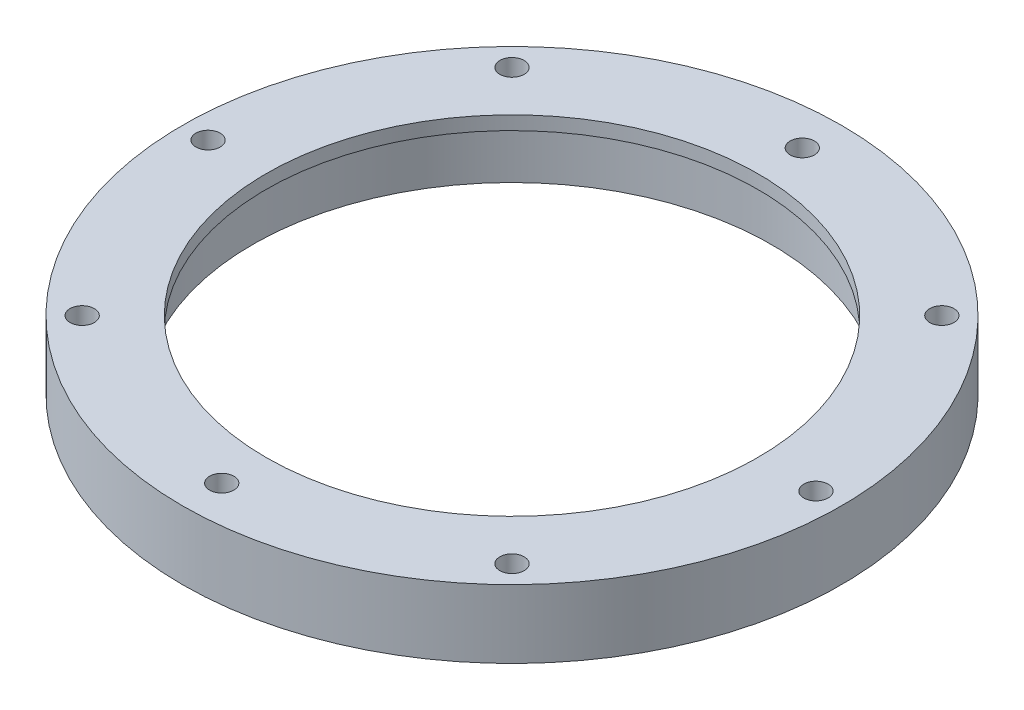
ISO-10303-21;
HEADER;
FILE_DESCRIPTION(('STEP AP214'),'2;1');
FILE_NAME('part.step','',(''),(''),'','','');
FILE_SCHEMA(('AUTOMOTIVE_DESIGN { 1 0 10303 214 1 1 1 1 }'));
ENDSEC;
DATA;
#1=APPLICATION_CONTEXT('core data for automotive mechanical design processes');
#2=APPLICATION_PROTOCOL_DEFINITION('international standard','automotive_design',2000,#1);
#3=PRODUCT_CONTEXT('',#1,'mechanical');
#4=PRODUCT('Part','Part','',(#3));
#5=PRODUCT_RELATED_PRODUCT_CATEGORY('part','',(#4));
#6=PRODUCT_DEFINITION_FORMATION('','',#4);
#7=PRODUCT_DEFINITION_CONTEXT('part definition',#1,'design');
#8=PRODUCT_DEFINITION('design','',#6,#7);
#9=PRODUCT_DEFINITION_SHAPE('','',#8);
#10=(LENGTH_UNIT() NAMED_UNIT(*) SI_UNIT(.MILLI.,.METRE.));
#11=(NAMED_UNIT(*) PLANE_ANGLE_UNIT() SI_UNIT($,.RADIAN.));
#12=(NAMED_UNIT(*) SI_UNIT($,.STERADIAN.) SOLID_ANGLE_UNIT());
#13=UNCERTAINTY_MEASURE_WITH_UNIT(LENGTH_MEASURE(1.E-05),#10,'distance_accuracy_value','');
#14=(GEOMETRIC_REPRESENTATION_CONTEXT(3) GLOBAL_UNCERTAINTY_ASSIGNED_CONTEXT((#13)) GLOBAL_UNIT_ASSIGNED_CONTEXT((#10,
#11,#12)) REPRESENTATION_CONTEXT('',''));
#15=CARTESIAN_POINT('',(0.,0.,0.));
#16=DIRECTION('',(0.,0.,1.));
#17=DIRECTION('',(1.,0.,0.));
#18=AXIS2_PLACEMENT_3D('',#15,#16,#17);
#19=CARTESIAN_POINT('',(0.,10.,0.));
#20=DIRECTION('',(0.,-1.,0.));
#21=DIRECTION('',(0.,0.,-1.));
#22=AXIS2_PLACEMENT_3D('',#19,#20,#21);
#23=CYLINDRICAL_SURFACE('',#22,38.);
#24=CARTESIAN_POINT('',(0.,0.,0.));
#25=DIRECTION('',(0.,1.,0.));
#26=DIRECTION('',(0.,0.,1.));
#27=AXIS2_PLACEMENT_3D('',#24,#25,#26);
#28=CIRCLE('',#27,38.);
#29=CARTESIAN_POINT('',(0.,0.,38.));
#30=VERTEX_POINT('',#29);
#31=EDGE_CURVE('E50',#30,#30,#28,.T.);
#32=ORIENTED_EDGE('',*,*,#31,.F.);
#33=EDGE_LOOP('',(#32));
#34=FACE_BOUND('',#33,.T.);
#35=CARTESIAN_POINT('',(0.,8.,0.));
#36=DIRECTION('',(0.,1.,0.));
#37=DIRECTION('',(0.,0.,1.));
#38=AXIS2_PLACEMENT_3D('',#35,#36,#37);
#39=CIRCLE('',#38,38.);
#40=CARTESIAN_POINT('',(0.,8.,38.));
#41=VERTEX_POINT('',#40);
#42=EDGE_CURVE('E81',#41,#41,#39,.T.);
#43=ORIENTED_EDGE('',*,*,#42,.T.);
#44=EDGE_LOOP('',(#43));
#45=FACE_BOUND('',#44,.T.);
#46=ADVANCED_FACE('F37',(#34,#45),#23,.F.);
#47=CARTESIAN_POINT('',(0.,10.,0.));
#48=DIRECTION('',(0.,1.,0.));
#49=DIRECTION('',(0.,0.,1.));
#50=AXIS2_PLACEMENT_3D('',#47,#48,#49);
#51=PLANE('',#50);
#52=CARTESIAN_POINT('',(5.5258133610514E-05,10.,42.5000795900453));
#53=DIRECTION('',(0.,1.,0.));
#54=DIRECTION('',(0.,0.,1.));
#55=AXIS2_PLACEMENT_3D('',#52,#53,#54);
#56=CIRCLE('',#55,1.775);
#57=CARTESIAN_POINT('',(5.5258133610514E-05,10.,44.2750795900453));
#58=VERTEX_POINT('',#57);
#59=EDGE_CURVE('E171',#58,#58,#56,.T.);
#60=ORIENTED_EDGE('',*,*,#59,.F.);
#61=EDGE_LOOP('',(#60));
#62=FACE_BOUND('',#61,.T.);
#63=CARTESIAN_POINT('',(2.4325513686696E-05,10.,-42.4999999985669));
#64=DIRECTION('',(0.,1.,0.));
#65=DIRECTION('',(0.,0.,1.));
#66=AXIS2_PLACEMENT_3D('',#63,#64,#65);
#67=CIRCLE('',#66,1.775);
#68=CARTESIAN_POINT('',(2.4325513686696E-05,10.,-40.7249999985669));
#69=VERTEX_POINT('',#68);
#70=EDGE_CURVE('E175',#69,#69,#67,.T.);
#71=ORIENTED_EDGE('',*,*,#70,.F.);
#72=EDGE_LOOP('',(#71));
#73=FACE_BOUND('',#72,.T.);
#74=CARTESIAN_POINT('',(31.4662517628014,10.,31.4662517628014));
#75=DIRECTION('',(0.,-1.,0.));
#76=DIRECTION('',(0.,0.,-1.));
#77=AXIS2_PLACEMENT_3D('',#74,#75,#76);
#78=CIRCLE('',#77,1.77500000000008);
#79=CARTESIAN_POINT('',(31.4662517628014,10.,29.6912517628013));
#80=VERTEX_POINT('',#79);
#81=EDGE_CURVE('E59',#80,#80,#78,.T.);
#82=ORIENTED_EDGE('',*,*,#81,.T.);
#83=EDGE_LOOP('',(#82));
#84=FACE_BOUND('',#83,.T.);
#85=CARTESIAN_POINT('',(44.5,10.,0.));
#86=DIRECTION('',(0.,-1.,0.));
#87=DIRECTION('',(0.,0.,-1.));
#88=AXIS2_PLACEMENT_3D('',#85,#86,#87);
#89=CIRCLE('',#88,1.77500000000015);
#90=CARTESIAN_POINT('',(44.5,10.,-1.77500000000015));
#91=VERTEX_POINT('',#90);
#92=EDGE_CURVE('E182',#91,#91,#89,.T.);
#93=ORIENTED_EDGE('',*,*,#92,.T.);
#94=EDGE_LOOP('',(#93));
#95=FACE_BOUND('',#94,.T.);
#96=CARTESIAN_POINT('',(31.4662517628014,10.,-31.4662517628014));
#97=DIRECTION('',(0.,-1.,0.));
#98=DIRECTION('',(0.,0.,-1.));
#99=AXIS2_PLACEMENT_3D('',#96,#97,#98);
#100=CIRCLE('',#99,1.77500000000024);
#101=CARTESIAN_POINT('',(31.4662517628014,10.,-33.2412517628016));
#102=VERTEX_POINT('',#101);
#103=EDGE_CURVE('E185',#102,#102,#100,.T.);
#104=ORIENTED_EDGE('',*,*,#103,.T.);
#105=EDGE_LOOP('',(#104));
#106=FACE_BOUND('',#105,.T.);
#107=CARTESIAN_POINT('',(-31.4662517628014,10.,-31.4662517628014));
#108=DIRECTION('',(0.,-1.,0.));
#109=DIRECTION('',(0.,0.,-1.));
#110=AXIS2_PLACEMENT_3D('',#107,#108,#109);
#111=CIRCLE('',#110,1.77500000000038);
#112=CARTESIAN_POINT('',(-31.4662517628014,10.,-33.2412517628018));
#113=VERTEX_POINT('',#112);
#114=EDGE_CURVE('E188',#113,#113,#111,.T.);
#115=ORIENTED_EDGE('',*,*,#114,.T.);
#116=EDGE_LOOP('',(#115));
#117=FACE_BOUND('',#116,.T.);
#118=CARTESIAN_POINT('',(-44.5,10.,0.));
#119=DIRECTION('',(0.,-1.,0.));
#120=DIRECTION('',(0.,0.,-1.));
#121=AXIS2_PLACEMENT_3D('',#118,#119,#120);
#122=CIRCLE('',#121,1.77500000000045);
#123=CARTESIAN_POINT('',(-44.5,10.,-1.77500000000046));
#124=VERTEX_POINT('',#123);
#125=EDGE_CURVE('E191',#124,#124,#122,.T.);
#126=ORIENTED_EDGE('',*,*,#125,.T.);
#127=EDGE_LOOP('',(#126));
#128=FACE_BOUND('',#127,.T.);
#129=CARTESIAN_POINT('',(-31.4662517628014,10.,31.4662517628013));
#130=DIRECTION('',(0.,-1.,0.));
#131=DIRECTION('',(0.,0.,-1.));
#132=AXIS2_PLACEMENT_3D('',#129,#130,#131);
#133=CIRCLE('',#132,1.77500000000053);
#134=CARTESIAN_POINT('',(-31.4662517628014,10.,29.6912517628008));
#135=VERTEX_POINT('',#134);
#136=EDGE_CURVE('E173',#135,#135,#133,.T.);
#137=ORIENTED_EDGE('',*,*,#136,.T.);
#138=EDGE_LOOP('',(#137));
#139=FACE_BOUND('',#138,.T.);
#140=CARTESIAN_POINT('',(0.,10.,0.));
#141=DIRECTION('',(0.,1.,0.));
#142=DIRECTION('',(0.,0.,1.));
#143=AXIS2_PLACEMENT_3D('',#140,#141,#142);
#144=CIRCLE('',#143,48.25);
#145=CARTESIAN_POINT('',(0.,10.,48.25));
#146=VERTEX_POINT('',#145);
#147=EDGE_CURVE('E10',#146,#146,#144,.T.);
#148=ORIENTED_EDGE('',*,*,#147,.T.);
#149=EDGE_LOOP('',(#148));
#150=FACE_BOUND('',#149,.T.);
#151=CARTESIAN_POINT('',(0.,10.,0.));
#152=DIRECTION('',(0.,1.,0.));
#153=DIRECTION('',(0.,0.,1.));
#154=AXIS2_PLACEMENT_3D('',#151,#152,#153);
#155=CIRCLE('',#154,36.);
#156=CARTESIAN_POINT('',(0.,10.,36.));
#157=VERTEX_POINT('',#156);
#158=EDGE_CURVE('E72',#157,#157,#155,.T.);
#159=ORIENTED_EDGE('',*,*,#158,.F.);
#160=EDGE_LOOP('',(#159));
#161=FACE_BOUND('',#160,.T.);
#162=ADVANCED_FACE('F93',(#62,#73,#84,#95,#106,#117,#128,#139,#150,#161),#51,.T.);
#163=CARTESIAN_POINT('',(0.,0.,0.));
#164=DIRECTION('',(0.,1.,0.));
#165=DIRECTION('',(0.,0.,1.));
#166=AXIS2_PLACEMENT_3D('',#163,#164,#165);
#167=PLANE('',#166);
#168=CARTESIAN_POINT('',(5.5258133610514E-05,0.,42.5000795900453));
#169=DIRECTION('',(0.,1.,0.));
#170=DIRECTION('',(0.,0.,1.));
#171=AXIS2_PLACEMENT_3D('',#168,#169,#170);
#172=CIRCLE('',#171,1.775);
#173=CARTESIAN_POINT('',(5.5258133610514E-05,0.,44.2750795900453));
#174=VERTEX_POINT('',#173);
#175=EDGE_CURVE('E112',#174,#174,#172,.F.);
#176=ORIENTED_EDGE('',*,*,#175,.F.);
#177=EDGE_LOOP('',(#176));
#178=FACE_BOUND('',#177,.T.);
#179=CARTESIAN_POINT('',(2.4325513686696E-05,0.,-42.4999999985669));
#180=DIRECTION('',(0.,1.,0.));
#181=DIRECTION('',(0.,0.,1.));
#182=AXIS2_PLACEMENT_3D('',#179,#180,#181);
#183=CIRCLE('',#182,1.775);
#184=CARTESIAN_POINT('',(2.4325513686696E-05,0.,-40.7249999985669));
#185=VERTEX_POINT('',#184);
#186=EDGE_CURVE('E115',#185,#185,#183,.F.);
#187=ORIENTED_EDGE('',*,*,#186,.F.);
#188=EDGE_LOOP('',(#187));
#189=FACE_BOUND('',#188,.T.);
#190=CARTESIAN_POINT('',(31.4662517628014,0.,31.4662517628014));
#191=DIRECTION('',(0.,1.,0.));
#192=DIRECTION('',(0.,0.,1.));
#193=AXIS2_PLACEMENT_3D('',#190,#191,#192);
#194=CIRCLE('',#193,1.77500000000008);
#195=CARTESIAN_POINT('',(31.4662517628014,0.,33.2412517628014));
#196=VERTEX_POINT('',#195);
#197=EDGE_CURVE('E41',#196,#196,#194,.T.);
#198=ORIENTED_EDGE('',*,*,#197,.T.);
#199=EDGE_LOOP('',(#198));
#200=FACE_BOUND('',#199,.T.);
#201=CARTESIAN_POINT('',(44.5,0.,0.));
#202=DIRECTION('',(0.,1.,0.));
#203=DIRECTION('',(0.,0.,1.));
#204=AXIS2_PLACEMENT_3D('',#201,#202,#203);
#205=CIRCLE('',#204,1.77500000000015);
#206=CARTESIAN_POINT('',(44.5,0.,1.77500000000016));
#207=VERTEX_POINT('',#206);
#208=EDGE_CURVE('E67',#207,#207,#205,.T.);
#209=ORIENTED_EDGE('',*,*,#208,.T.);
#210=EDGE_LOOP('',(#209));
#211=FACE_BOUND('',#210,.T.);
#212=CARTESIAN_POINT('',(31.4662517628014,0.,-31.4662517628014));
#213=DIRECTION('',(0.,1.,0.));
#214=DIRECTION('',(0.,0.,1.));
#215=AXIS2_PLACEMENT_3D('',#212,#213,#214);
#216=CIRCLE('',#215,1.77500000000024);
#217=CARTESIAN_POINT('',(31.4662517628014,0.,-29.6912517628011));
#218=VERTEX_POINT('',#217);
#219=EDGE_CURVE('E65',#218,#218,#216,.T.);
#220=ORIENTED_EDGE('',*,*,#219,.T.);
#221=EDGE_LOOP('',(#220));
#222=FACE_BOUND('',#221,.T.);
#223=CARTESIAN_POINT('',(-31.4662517628014,0.,-31.4662517628014));
#224=DIRECTION('',(0.,1.,0.));
#225=DIRECTION('',(0.,0.,1.));
#226=AXIS2_PLACEMENT_3D('',#223,#224,#225);
#227=CIRCLE('',#226,1.77500000000038);
#228=CARTESIAN_POINT('',(-31.4662517628014,0.,-29.691251762801));
#229=VERTEX_POINT('',#228);
#230=EDGE_CURVE('E62',#229,#229,#227,.T.);
#231=ORIENTED_EDGE('',*,*,#230,.T.);
#232=EDGE_LOOP('',(#231));
#233=FACE_BOUND('',#232,.T.);
#234=CARTESIAN_POINT('',(-44.5,0.,0.));
#235=DIRECTION('',(0.,1.,0.));
#236=DIRECTION('',(0.,0.,1.));
#237=AXIS2_PLACEMENT_3D('',#234,#235,#236);
#238=CIRCLE('',#237,1.77500000000045);
#239=CARTESIAN_POINT('',(-44.5,0.,1.77500000000045));
#240=VERTEX_POINT('',#239);
#241=EDGE_CURVE('E58',#240,#240,#238,.T.);
#242=ORIENTED_EDGE('',*,*,#241,.T.);
#243=EDGE_LOOP('',(#242));
#244=FACE_BOUND('',#243,.T.);
#245=CARTESIAN_POINT('',(-31.4662517628014,0.,31.4662517628013));
#246=DIRECTION('',(0.,1.,0.));
#247=DIRECTION('',(0.,0.,1.));
#248=AXIS2_PLACEMENT_3D('',#245,#246,#247);
#249=CIRCLE('',#248,1.77500000000053);
#250=CARTESIAN_POINT('',(-31.4662517628014,0.,33.2412517628019));
#251=VERTEX_POINT('',#250);
#252=EDGE_CURVE('E55',#251,#251,#249,.T.);
#253=ORIENTED_EDGE('',*,*,#252,.T.);
#254=EDGE_LOOP('',(#253));
#255=FACE_BOUND('',#254,.T.);
#256=CARTESIAN_POINT('',(0.,0.,0.));
#257=DIRECTION('',(0.,1.,0.));
#258=DIRECTION('',(0.,0.,1.));
#259=AXIS2_PLACEMENT_3D('',#256,#257,#258);
#260=CIRCLE('',#259,48.25);
#261=CARTESIAN_POINT('',(0.,0.,48.25));
#262=VERTEX_POINT('',#261);
#263=EDGE_CURVE('E45',#262,#262,#260,.T.);
#264=ORIENTED_EDGE('',*,*,#263,.F.);
#265=EDGE_LOOP('',(#264));
#266=FACE_BOUND('',#265,.T.);
#267=ORIENTED_EDGE('',*,*,#31,.T.);
#268=EDGE_LOOP('',(#267));
#269=FACE_BOUND('',#268,.T.);
#270=ADVANCED_FACE('F90',(#178,#189,#200,#211,#222,#233,#244,#255,#266,#269),#167,.F.);
#271=CARTESIAN_POINT('',(0.,10.,0.));
#272=DIRECTION('',(0.,-1.,0.));
#273=DIRECTION('',(0.,0.,-1.));
#274=AXIS2_PLACEMENT_3D('',#271,#272,#273);
#275=CYLINDRICAL_SURFACE('',#274,48.25);
#276=ORIENTED_EDGE('',*,*,#147,.F.);
#277=EDGE_LOOP('',(#276));
#278=FACE_BOUND('',#277,.T.);
#279=ORIENTED_EDGE('',*,*,#263,.T.);
#280=EDGE_LOOP('',(#279));
#281=FACE_BOUND('',#280,.T.);
#282=ADVANCED_FACE('F39',(#278,#281),#275,.T.);
#283=CARTESIAN_POINT('',(0.,8.,0.));
#284=DIRECTION('',(0.,1.,0.));
#285=DIRECTION('',(0.,0.,1.));
#286=AXIS2_PLACEMENT_3D('',#283,#284,#285);
#287=PLANE('',#286);
#288=CARTESIAN_POINT('',(0.,8.,0.));
#289=DIRECTION('',(0.,1.,0.));
#290=DIRECTION('',(0.,0.,1.));
#291=AXIS2_PLACEMENT_3D('',#288,#289,#290);
#292=CIRCLE('',#291,36.);
#293=CARTESIAN_POINT('',(0.,8.,36.));
#294=VERTEX_POINT('',#293);
#295=EDGE_CURVE('E76',#294,#294,#292,.T.);
#296=ORIENTED_EDGE('',*,*,#295,.T.);
#297=EDGE_LOOP('',(#296));
#298=FACE_BOUND('',#297,.T.);
#299=ORIENTED_EDGE('',*,*,#42,.F.);
#300=EDGE_LOOP('',(#299));
#301=FACE_BOUND('',#300,.T.);
#302=ADVANCED_FACE('F101',(#298,#301),#287,.F.);
#303=CARTESIAN_POINT('',(0.,8.,0.));
#304=DIRECTION('',(0.,1.,0.));
#305=DIRECTION('',(0.,0.,1.));
#306=AXIS2_PLACEMENT_3D('',#303,#304,#305);
#307=CYLINDRICAL_SURFACE('',#306,36.);
#308=ORIENTED_EDGE('',*,*,#295,.F.);
#309=EDGE_LOOP('',(#308));
#310=FACE_BOUND('',#309,.T.);
#311=ORIENTED_EDGE('',*,*,#158,.T.);
#312=EDGE_LOOP('',(#311));
#313=FACE_BOUND('',#312,.T.);
#314=ADVANCED_FACE('F131',(#310,#313),#307,.F.);
#315=CARTESIAN_POINT('',(-31.4662517628014,10.,31.4662517628013));
#316=DIRECTION('',(0.,-1.,0.));
#317=DIRECTION('',(0.,0.,-1.));
#318=AXIS2_PLACEMENT_3D('',#315,#316,#317);
#319=CYLINDRICAL_SURFACE('',#318,1.77500000000053);
#320=ORIENTED_EDGE('',*,*,#136,.F.);
#321=EDGE_LOOP('',(#320));
#322=FACE_BOUND('',#321,.T.);
#323=ORIENTED_EDGE('',*,*,#252,.F.);
#324=EDGE_LOOP('',(#323));
#325=FACE_BOUND('',#324,.T.);
#326=ADVANCED_FACE('F128',(#322,#325),#319,.F.);
#327=CARTESIAN_POINT('',(-44.5,10.,0.));
#328=DIRECTION('',(0.,-1.,0.));
#329=DIRECTION('',(0.,0.,-1.));
#330=AXIS2_PLACEMENT_3D('',#327,#328,#329);
#331=CYLINDRICAL_SURFACE('',#330,1.77500000000045);
#332=ORIENTED_EDGE('',*,*,#125,.F.);
#333=EDGE_LOOP('',(#332));
#334=FACE_BOUND('',#333,.T.);
#335=ORIENTED_EDGE('',*,*,#241,.F.);
#336=EDGE_LOOP('',(#335));
#337=FACE_BOUND('',#336,.T.);
#338=ADVANCED_FACE('F130',(#334,#337),#331,.F.);
#339=CARTESIAN_POINT('',(-31.4662517628014,10.,-31.4662517628014));
#340=DIRECTION('',(0.,-1.,0.));
#341=DIRECTION('',(0.,0.,-1.));
#342=AXIS2_PLACEMENT_3D('',#339,#340,#341);
#343=CYLINDRICAL_SURFACE('',#342,1.77500000000038);
#344=ORIENTED_EDGE('',*,*,#114,.F.);
#345=EDGE_LOOP('',(#344));
#346=FACE_BOUND('',#345,.T.);
#347=ORIENTED_EDGE('',*,*,#230,.F.);
#348=EDGE_LOOP('',(#347));
#349=FACE_BOUND('',#348,.T.);
#350=ADVANCED_FACE('F138',(#346,#349),#343,.F.);
#351=CARTESIAN_POINT('',(31.4662517628014,10.,-31.4662517628014));
#352=DIRECTION('',(0.,-1.,0.));
#353=DIRECTION('',(0.,0.,-1.));
#354=AXIS2_PLACEMENT_3D('',#351,#352,#353);
#355=CYLINDRICAL_SURFACE('',#354,1.77500000000024);
#356=ORIENTED_EDGE('',*,*,#103,.F.);
#357=EDGE_LOOP('',(#356));
#358=FACE_BOUND('',#357,.T.);
#359=ORIENTED_EDGE('',*,*,#219,.F.);
#360=EDGE_LOOP('',(#359));
#361=FACE_BOUND('',#360,.T.);
#362=ADVANCED_FACE('F146',(#358,#361),#355,.F.);
#363=CARTESIAN_POINT('',(44.5,10.,0.));
#364=DIRECTION('',(0.,-1.,0.));
#365=DIRECTION('',(0.,0.,-1.));
#366=AXIS2_PLACEMENT_3D('',#363,#364,#365);
#367=CYLINDRICAL_SURFACE('',#366,1.77500000000015);
#368=ORIENTED_EDGE('',*,*,#92,.F.);
#369=EDGE_LOOP('',(#368));
#370=FACE_BOUND('',#369,.T.);
#371=ORIENTED_EDGE('',*,*,#208,.F.);
#372=EDGE_LOOP('',(#371));
#373=FACE_BOUND('',#372,.T.);
#374=ADVANCED_FACE('F150',(#370,#373),#367,.F.);
#375=CARTESIAN_POINT('',(31.4662517628014,10.,31.4662517628014));
#376=DIRECTION('',(0.,-1.,0.));
#377=DIRECTION('',(0.,0.,-1.));
#378=AXIS2_PLACEMENT_3D('',#375,#376,#377);
#379=CYLINDRICAL_SURFACE('',#378,1.77500000000008);
#380=ORIENTED_EDGE('',*,*,#81,.F.);
#381=EDGE_LOOP('',(#380));
#382=FACE_BOUND('',#381,.T.);
#383=ORIENTED_EDGE('',*,*,#197,.F.);
#384=EDGE_LOOP('',(#383));
#385=FACE_BOUND('',#384,.T.);
#386=ADVANCED_FACE('F154',(#382,#385),#379,.F.);
#387=CARTESIAN_POINT('',(2.4325513686696E-05,-5.02045814642448,-42.4999999985669));
#388=DIRECTION('',(0.,1.,0.));
#389=DIRECTION('',(0.,0.,1.));
#390=AXIS2_PLACEMENT_3D('',#387,#388,#389);
#391=CYLINDRICAL_SURFACE('',#390,1.775);
#392=ORIENTED_EDGE('',*,*,#186,.T.);
#393=EDGE_LOOP('',(#392));
#394=FACE_BOUND('',#393,.T.);
#395=ORIENTED_EDGE('',*,*,#70,.T.);
#396=EDGE_LOOP('',(#395));
#397=FACE_BOUND('',#396,.T.);
#398=ADVANCED_FACE('F158',(#394,#397),#391,.F.);
#399=CARTESIAN_POINT('',(5.5258133610514E-05,-5.02045814642448,42.5000795900453));
#400=DIRECTION('',(0.,1.,0.));
#401=DIRECTION('',(0.,0.,1.));
#402=AXIS2_PLACEMENT_3D('',#399,#400,#401);
#403=CYLINDRICAL_SURFACE('',#402,1.775);
#404=ORIENTED_EDGE('',*,*,#175,.T.);
#405=EDGE_LOOP('',(#404));
#406=FACE_BOUND('',#405,.T.);
#407=ORIENTED_EDGE('',*,*,#59,.T.);
#408=EDGE_LOOP('',(#407));
#409=FACE_BOUND('',#408,.T.);
#410=ADVANCED_FACE('F162',(#406,#409),#403,.F.);
#411=CLOSED_SHELL('',(#46,#162,#270,#282,#302,#314,#326,#338,#350,#362,#374,#386,#398,#410));
#412=MANIFOLD_SOLID_BREP('B2',#411);
#413=ADVANCED_BREP_SHAPE_REPRESENTATION('',(#18,#412),#14);
#414=SHAPE_DEFINITION_REPRESENTATION(#9,#413);
ENDSEC;
END-ISO-10303-21;
